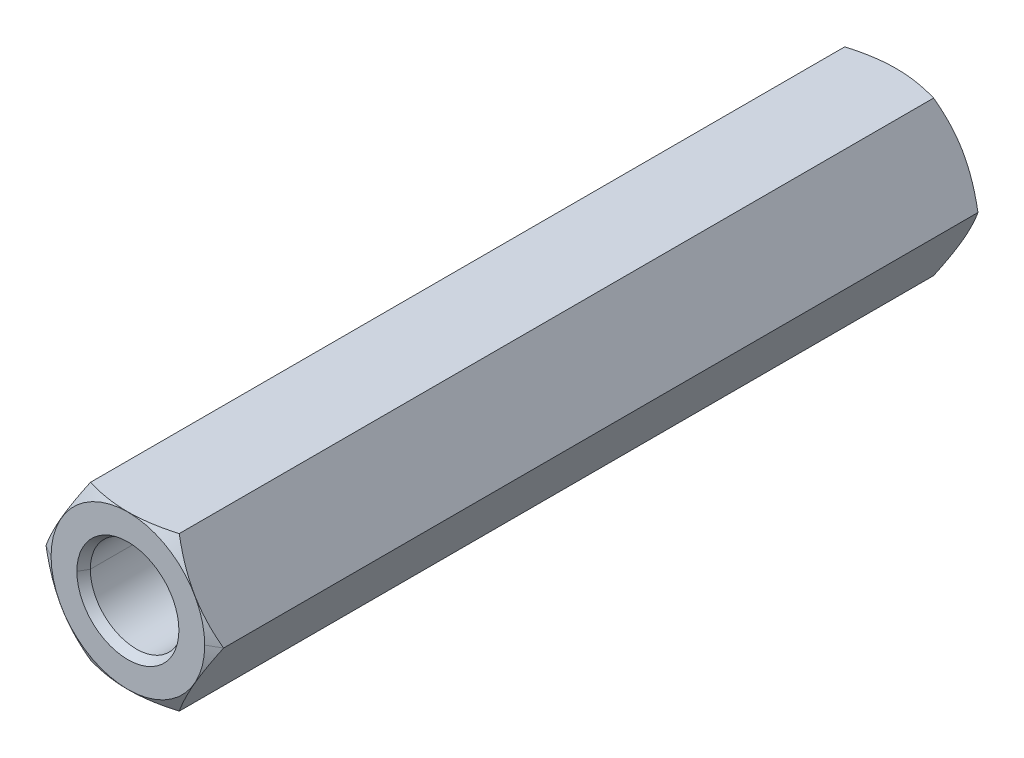
ISO-10303-21;
HEADER;
FILE_DESCRIPTION(('STEP AP214'),'2;1');
FILE_NAME('part.step','',(''),(''),'','','');
FILE_SCHEMA(('AUTOMOTIVE_DESIGN { 1 0 10303 214 1 1 1 1 }'));
ENDSEC;
DATA;
#1=APPLICATION_CONTEXT('core data for automotive mechanical design processes');
#2=APPLICATION_PROTOCOL_DEFINITION('international standard','automotive_design',2000,#1);
#3=PRODUCT_CONTEXT('',#1,'mechanical');
#4=PRODUCT('Part','Part','',(#3));
#5=PRODUCT_RELATED_PRODUCT_CATEGORY('part','',(#4));
#6=PRODUCT_DEFINITION_FORMATION('','',#4);
#7=PRODUCT_DEFINITION_CONTEXT('part definition',#1,'design');
#8=PRODUCT_DEFINITION('design','',#6,#7);
#9=PRODUCT_DEFINITION_SHAPE('','',#8);
#10=(LENGTH_UNIT() NAMED_UNIT(*) SI_UNIT(.MILLI.,.METRE.));
#11=(NAMED_UNIT(*) PLANE_ANGLE_UNIT() SI_UNIT($,.RADIAN.));
#12=(NAMED_UNIT(*) SI_UNIT($,.STERADIAN.) SOLID_ANGLE_UNIT());
#13=UNCERTAINTY_MEASURE_WITH_UNIT(LENGTH_MEASURE(1.E-05),#10,'distance_accuracy_value','');
#14=(GEOMETRIC_REPRESENTATION_CONTEXT(3) GLOBAL_UNCERTAINTY_ASSIGNED_CONTEXT((#13)) GLOBAL_UNIT_ASSIGNED_CONTEXT((#10,
#11,#12)) REPRESENTATION_CONTEXT('',''));
#15=CARTESIAN_POINT('',(0.,0.,0.));
#16=DIRECTION('',(0.,0.,1.));
#17=DIRECTION('',(1.,0.,0.));
#18=AXIS2_PLACEMENT_3D('',#15,#16,#17);
#19=CARTESIAN_POINT('',(116.318744279938,128.56204329235,90.4476083123826));
#20=DIRECTION('',(0.,0.,-1.));
#21=DIRECTION('',(1.,0.,0.));
#22=AXIS2_PLACEMENT_3D('',#19,#20,#21);
#23=CONICAL_SURFACE('',#22,1.73205080757048,1.047197551197);
#24=DIRECTION('',(0.86602540378464,0.,-0.499999999999652));
#25=VECTOR('',#24,1.);
#26=CARTESIAN_POINT('',(118.050795087508,128.56204329235,90.4476083123826));
#27=LINE('',#26,#25);
#28=CARTESIAN_POINT('',(116.318744279938,128.56204329235,91.4476083123826));
#29=VERTEX_POINT('',#28);
#30=CARTESIAN_POINT('',(117.818744279938,128.56204329235,90.5815829085986));
#31=VERTEX_POINT('',#30);
#32=EDGE_CURVE('E67',#29,#31,#27,.T.);
#33=ORIENTED_EDGE('',*,*,#32,.F.);
#34=DIRECTION('',(-0.86602540378464,0.,-0.499999999999652));
#35=VECTOR('',#34,1.);
#36=CARTESIAN_POINT('',(114.586693472367,128.56204329235,90.4476083123826));
#37=LINE('',#36,#35);
#38=CARTESIAN_POINT('',(114.818744279938,128.56204329235,90.5815829085986));
#39=VERTEX_POINT('',#38);
#40=EDGE_CURVE('E11',#29,#39,#37,.T.);
#41=ORIENTED_EDGE('',*,*,#40,.T.);
#42=CARTESIAN_POINT('',(116.318744279938,128.56204329235,90.5815829085986));
#43=DIRECTION('',(0.,0.,1.));
#44=DIRECTION('',(1.,0.,0.));
#45=AXIS2_PLACEMENT_3D('',#42,#43,#44);
#46=CIRCLE('',#45,1.5);
#47=EDGE_CURVE('E55',#31,#39,#46,.T.);
#48=ORIENTED_EDGE('',*,*,#47,.F.);
#49=EDGE_LOOP('',(#33,#41,#48));
#50=FACE_BOUND('',#49,.T.);
#51=ADVANCED_FACE('F44',(#50),#23,.F.);
#52=CARTESIAN_POINT('',(116.318744279938,128.56204329235,90.5815829085986));
#53=DIRECTION('',(0.,0.,-1.));
#54=DIRECTION('',(1.,0.,0.));
#55=AXIS2_PLACEMENT_3D('',#52,#53,#54);
#56=CYLINDRICAL_SURFACE('',#55,1.5);
#57=ORIENTED_EDGE('',*,*,#47,.T.);
#58=DIRECTION('',(0.,0.,-1.));
#59=VECTOR('',#58,1.);
#60=CARTESIAN_POINT('',(114.818744279938,128.56204329235,90.5815829085986));
#61=LINE('',#60,#59);
#62=CARTESIAN_POINT('',(114.818744279938,128.56204329235,80.8587110378087));
#63=VERTEX_POINT('',#62);
#64=EDGE_CURVE('E235',#39,#63,#61,.T.);
#65=ORIENTED_EDGE('',*,*,#64,.T.);
#66=CARTESIAN_POINT('',(116.318744279938,128.56204329235,80.8587110378087));
#67=DIRECTION('',(0.,0.,1.));
#68=DIRECTION('',(1.,0.,0.));
#69=AXIS2_PLACEMENT_3D('',#66,#67,#68);
#70=CIRCLE('',#69,1.5);
#71=CARTESIAN_POINT('',(117.818744279938,128.56204329235,80.8587110378087));
#72=VERTEX_POINT('',#71);
#73=EDGE_CURVE('E239',#72,#63,#70,.T.);
#74=ORIENTED_EDGE('',*,*,#73,.F.);
#75=DIRECTION('',(0.,0.,-1.));
#76=VECTOR('',#75,1.);
#77=CARTESIAN_POINT('',(117.818744279938,128.56204329235,90.5815829085986));
#78=LINE('',#77,#76);
#79=EDGE_CURVE('E370',#31,#72,#78,.T.);
#80=ORIENTED_EDGE('',*,*,#79,.F.);
#81=EDGE_LOOP('',(#57,#65,#74,#80));
#82=FACE_BOUND('',#81,.T.);
#83=ADVANCED_FACE('F484',(#82),#56,.F.);
#84=CARTESIAN_POINT('',(116.318744279938,128.56204329235,80.8587110378087));
#85=DIRECTION('',(0.,0.,-1.));
#86=DIRECTION('',(1.,0.,0.));
#87=AXIS2_PLACEMENT_3D('',#84,#85,#86);
#88=CONICAL_SURFACE('',#87,1.5,0.5235987756);
#89=ORIENTED_EDGE('',*,*,#73,.T.);
#90=DIRECTION('',(-0.500000000001473,0.,-0.866025403783588));
#91=VECTOR('',#90,1.);
#92=CARTESIAN_POINT('',(114.818744279938,128.56204329235,80.8587110378087));
#93=LINE('',#92,#91);
#94=CARTESIAN_POINT('',(114.658744279938,128.56204329235,80.5815829085986));
#95=VERTEX_POINT('',#94);
#96=EDGE_CURVE('E270',#63,#95,#93,.T.);
#97=ORIENTED_EDGE('',*,*,#96,.T.);
#98=CARTESIAN_POINT('',(116.318744279938,128.56204329235,80.5815829085986));
#99=DIRECTION('',(0.,0.,1.));
#100=DIRECTION('',(1.,0.,0.));
#101=AXIS2_PLACEMENT_3D('',#98,#99,#100);
#102=CIRCLE('',#101,1.66);
#103=CARTESIAN_POINT('',(117.978744279938,128.56204329235,80.5815829085986));
#104=VERTEX_POINT('',#103);
#105=EDGE_CURVE('E233',#104,#95,#102,.T.);
#106=ORIENTED_EDGE('',*,*,#105,.F.);
#107=DIRECTION('',(0.500000000001473,0.,-0.866025403783588));
#108=VECTOR('',#107,1.);
#109=CARTESIAN_POINT('',(117.818744279938,128.56204329235,80.8587110378087));
#110=LINE('',#109,#108);
#111=EDGE_CURVE('E294',#72,#104,#110,.T.);
#112=ORIENTED_EDGE('',*,*,#111,.F.);
#113=EDGE_LOOP('',(#89,#97,#106,#112));
#114=FACE_BOUND('',#113,.T.);
#115=ADVANCED_FACE('F477',(#114),#88,.F.);
#116=CARTESIAN_POINT('',(116.318744279938,128.56204329235,80.5815829085986));
#117=DIRECTION('',(0.,0.,1.));
#118=DIRECTION('',(1.,0.,0.));
#119=AXIS2_PLACEMENT_3D('',#116,#117,#118);
#120=CONICAL_SURFACE('',#119,2.5,1.047197551197);
#121=CARTESIAN_POINT('',(116.318744279938,128.56204329235,80.5815829085986));
#122=DIRECTION('',(0.,0.,1.));
#123=DIRECTION('',(1.,0.,0.));
#124=AXIS2_PLACEMENT_3D('',#121,#122,#123);
#125=CIRCLE('',#124,2.5);
#126=CARTESIAN_POINT('',(118.818744279938,128.56204329235,80.5815829085986));
#127=VERTEX_POINT('',#126);
#128=CARTESIAN_POINT('',(113.818744279938,128.56204329235,80.5815829085986));
#129=VERTEX_POINT('',#128);
#130=EDGE_CURVE('E277',#127,#129,#125,.T.);
#131=ORIENTED_EDGE('',*,*,#130,.T.);
#132=DIRECTION('',(-0.86602540378464,0.,0.499999999999652));
#133=VECTOR('',#132,1.);
#134=CARTESIAN_POINT('',(113.818744279938,128.56204329235,80.5815829085986));
#135=LINE('',#134,#133);
#136=CARTESIAN_POINT('',(113.428744279938,128.56204329235,80.8067495135827));
#137=VERTEX_POINT('',#136);
#138=EDGE_CURVE('E224',#129,#137,#135,.T.);
#139=ORIENTED_EDGE('',*,*,#138,.T.);
#140=CARTESIAN_POINT('',(114.873744279938,131.064856709287,80.8067495135827));
#141=CARTESIAN_POINT('',(114.151244279938,129.813450000819,80.3896139440931));
#142=CARTESIAN_POINT('',(113.428744279938,128.56204329235,80.8067495135827));
#143=(BOUNDED_CURVE() B_SPLINE_CURVE(2,(#140,#141,#142),.UNSPECIFIED.,.F.,
.F.) B_SPLINE_CURVE_WITH_KNOTS((3,3),(0.,1.),
.UNSPECIFIED.) CURVE() GEOMETRIC_REPRESENTATION_ITEM() RATIONAL_B_SPLINE_CURVE((1.,
1.15470053837935,1.)) REPRESENTATION_ITEM(''));
#144=CARTESIAN_POINT('',(114.873744279938,131.064856709287,80.8067495135827));
#145=VERTEX_POINT('',#144);
#146=EDGE_CURVE('E298',#145,#137,#143,.T.);
#147=ORIENTED_EDGE('',*,*,#146,.F.);
#148=CARTESIAN_POINT('',(117.763744279938,131.064856709287,80.8067495135827));
#149=CARTESIAN_POINT('',(116.318744279938,131.064856709288,80.3896139440931));
#150=CARTESIAN_POINT('',(114.873744279938,131.064856709287,80.8067495135827));
#151=(BOUNDED_CURVE() B_SPLINE_CURVE(2,(#148,#149,#150),.UNSPECIFIED.,.F.,
.F.) B_SPLINE_CURVE_WITH_KNOTS((3,3),(0.,1.),
.UNSPECIFIED.) CURVE() GEOMETRIC_REPRESENTATION_ITEM() RATIONAL_B_SPLINE_CURVE((1.,
1.15470053837926,1.)) REPRESENTATION_ITEM(''));
#152=CARTESIAN_POINT('',(117.763744279938,131.064856709287,80.8067495135827));
#153=VERTEX_POINT('',#152);
#154=EDGE_CURVE('E330',#153,#145,#151,.T.);
#155=ORIENTED_EDGE('',*,*,#154,.F.);
#156=CARTESIAN_POINT('',(119.208744279938,128.56204329235,80.8067495135827));
#157=CARTESIAN_POINT('',(118.486244279938,129.813450000819,80.389613944093));
#158=CARTESIAN_POINT('',(117.763744279938,131.064856709287,80.8067495135827));
#159=(BOUNDED_CURVE() B_SPLINE_CURVE(2,(#156,#157,#158),.UNSPECIFIED.,.F.,
.F.) B_SPLINE_CURVE_WITH_KNOTS((3,3),(0.,1.),
.UNSPECIFIED.) CURVE() GEOMETRIC_REPRESENTATION_ITEM() RATIONAL_B_SPLINE_CURVE((1.,
1.15470053837946,1.)) REPRESENTATION_ITEM(''));
#160=CARTESIAN_POINT('',(119.208744279938,128.56204329235,80.8067495135827));
#161=VERTEX_POINT('',#160);
#162=EDGE_CURVE('E251',#161,#153,#159,.T.);
#163=ORIENTED_EDGE('',*,*,#162,.F.);
#164=DIRECTION('',(0.86602540378464,0.,0.499999999999652));
#165=VECTOR('',#164,1.);
#166=CARTESIAN_POINT('',(118.818744279938,128.56204329235,80.5815829085986));
#167=LINE('',#166,#165);
#168=EDGE_CURVE('E252',#127,#161,#167,.T.);
#169=ORIENTED_EDGE('',*,*,#168,.F.);
#170=EDGE_LOOP('',(#131,#139,#147,#155,#163,#169));
#171=FACE_BOUND('',#170,.T.);
#172=ADVANCED_FACE('F459',(#171),#120,.T.);
#173=CARTESIAN_POINT('',(116.318744279938,128.56204329235,105.356416303615));
#174=DIRECTION('',(0.,0.,-1.));
#175=DIRECTION('',(1.,0.,0.));
#176=AXIS2_PLACEMENT_3D('',#173,#174,#175);
#177=CONICAL_SURFACE('',#176,2.89,1.047197551197);
#178=CARTESIAN_POINT('',(116.318744279938,128.56204329235,105.581582908599));
#179=DIRECTION('',(0.,0.,1.));
#180=DIRECTION('',(1.,0.,0.));
#181=AXIS2_PLACEMENT_3D('',#178,#179,#180);
#182=CIRCLE('',#181,2.5);
#183=CARTESIAN_POINT('',(113.818744279938,128.56204329235,105.581582908599));
#184=VERTEX_POINT('',#183);
#185=CARTESIAN_POINT('',(118.818744279938,128.56204329235,105.581582908599));
#186=VERTEX_POINT('',#185);
#187=EDGE_CURVE('E220',#184,#186,#182,.T.);
#188=ORIENTED_EDGE('',*,*,#187,.F.);
#189=DIRECTION('',(-0.86602540378464,0.,-0.499999999999652));
#190=VECTOR('',#189,1.);
#191=CARTESIAN_POINT('',(113.428744279938,128.56204329235,105.356416303615));
#192=LINE('',#191,#190);
#193=CARTESIAN_POINT('',(113.428744279938,128.562043292351,105.356416303615));
#194=VERTEX_POINT('',#193);
#195=EDGE_CURVE('E205',#184,#194,#192,.T.);
#196=ORIENTED_EDGE('',*,*,#195,.T.);
#197=CARTESIAN_POINT('',(114.873744279938,126.059229875413,105.356416303615));
#198=CARTESIAN_POINT('',(114.151244279938,127.310636583881,105.773551873104));
#199=CARTESIAN_POINT('',(113.428744279938,128.562043292351,105.356416303615));
#200=(BOUNDED_CURVE() B_SPLINE_CURVE(2,(#197,#198,#199),.UNSPECIFIED.,.F.,
.F.) B_SPLINE_CURVE_WITH_KNOTS((3,3),(0.,1.),
.UNSPECIFIED.) CURVE() GEOMETRIC_REPRESENTATION_ITEM() RATIONAL_B_SPLINE_CURVE((1.,
1.15470053837936,1.)) REPRESENTATION_ITEM(''));
#201=CARTESIAN_POINT('',(114.873744279938,126.059229875413,105.356416303615));
#202=VERTEX_POINT('',#201);
#203=EDGE_CURVE('E262',#202,#194,#200,.T.);
#204=ORIENTED_EDGE('',*,*,#203,.F.);
#205=CARTESIAN_POINT('',(117.763744279938,126.059229875413,105.356416303615));
#206=CARTESIAN_POINT('',(116.318744279938,126.059229875413,105.773551873104));
#207=CARTESIAN_POINT('',(114.873744279938,126.059229875413,105.356416303615));
#208=(BOUNDED_CURVE() B_SPLINE_CURVE(2,(#205,#206,#207),.UNSPECIFIED.,.F.,
.F.) B_SPLINE_CURVE_WITH_KNOTS((3,3),(0.,1.),
.UNSPECIFIED.) CURVE() GEOMETRIC_REPRESENTATION_ITEM() RATIONAL_B_SPLINE_CURVE((1.,
1.15470053837925,1.)) REPRESENTATION_ITEM(''));
#209=CARTESIAN_POINT('',(117.763744279938,126.059229875413,105.356416303615));
#210=VERTEX_POINT('',#209);
#211=EDGE_CURVE('E336',#210,#202,#208,.T.);
#212=ORIENTED_EDGE('',*,*,#211,.F.);
#213=CARTESIAN_POINT('',(119.208744279938,128.56204329235,105.356416303615));
#214=CARTESIAN_POINT('',(118.486244279938,127.310636583882,105.773551873104));
#215=CARTESIAN_POINT('',(117.763744279938,126.059229875413,105.356416303615));
#216=(BOUNDED_CURVE() B_SPLINE_CURVE(2,(#213,#214,#215),.UNSPECIFIED.,.F.,
.F.) B_SPLINE_CURVE_WITH_KNOTS((3,3),(0.,1.),
.UNSPECIFIED.) CURVE() GEOMETRIC_REPRESENTATION_ITEM() RATIONAL_B_SPLINE_CURVE((1.,
1.15470053837944,1.)) REPRESENTATION_ITEM(''));
#217=CARTESIAN_POINT('',(119.208744279938,128.56204329235,105.356416303615));
#218=VERTEX_POINT('',#217);
#219=EDGE_CURVE('E257',#218,#210,#216,.T.);
#220=ORIENTED_EDGE('',*,*,#219,.F.);
#221=DIRECTION('',(0.86602540378464,0.,-0.499999999999652));
#222=VECTOR('',#221,1.);
#223=CARTESIAN_POINT('',(119.208744279938,128.56204329235,105.356416303615));
#224=LINE('',#223,#222);
#225=EDGE_CURVE('E240',#186,#218,#224,.T.);
#226=ORIENTED_EDGE('',*,*,#225,.F.);
#227=EDGE_LOOP('',(#188,#196,#204,#212,#220,#226));
#228=FACE_BOUND('',#227,.T.);
#229=ADVANCED_FACE('F515',(#228),#177,.T.);
#230=CARTESIAN_POINT('',(116.318744279938,128.56204329235,105.581582908599));
#231=DIRECTION('',(0.,0.,1.));
#232=DIRECTION('',(1.,0.,0.));
#233=AXIS2_PLACEMENT_3D('',#230,#231,#232);
#234=CONICAL_SURFACE('',#233,1.65999999999899,0.523598775598);
#235=CARTESIAN_POINT('',(116.318744279938,128.56204329235,105.304454779389));
#236=DIRECTION('',(0.,0.,1.));
#237=DIRECTION('',(1.,0.,0.));
#238=AXIS2_PLACEMENT_3D('',#235,#236,#237);
#239=CIRCLE('',#238,1.5);
#240=CARTESIAN_POINT('',(114.818744279938,128.56204329235,105.304454779389));
#241=VERTEX_POINT('',#240);
#242=CARTESIAN_POINT('',(117.818744279938,128.56204329235,105.304454779389));
#243=VERTEX_POINT('',#242);
#244=EDGE_CURVE('E199',#241,#243,#239,.T.);
#245=ORIENTED_EDGE('',*,*,#244,.F.);
#246=DIRECTION('',(-0.499999999999741,0.,0.866025403784588));
#247=VECTOR('',#246,1.);
#248=CARTESIAN_POINT('',(114.658744279939,128.56204329235,105.581582908599));
#249=LINE('',#248,#247);
#250=CARTESIAN_POINT('',(114.658744279939,128.56204329235,105.581582908599));
#251=VERTEX_POINT('',#250);
#252=EDGE_CURVE('E193',#241,#251,#249,.T.);
#253=ORIENTED_EDGE('',*,*,#252,.T.);
#254=CARTESIAN_POINT('',(116.318744279938,128.56204329235,105.581582908599));
#255=DIRECTION('',(0.,0.,1.));
#256=DIRECTION('',(1.,0.,0.));
#257=AXIS2_PLACEMENT_3D('',#254,#255,#256);
#258=CIRCLE('',#257,1.65999999999899);
#259=CARTESIAN_POINT('',(117.978744279937,128.56204329235,105.581582908599));
#260=VERTEX_POINT('',#259);
#261=EDGE_CURVE('E186',#251,#260,#258,.T.);
#262=ORIENTED_EDGE('',*,*,#261,.T.);
#263=DIRECTION('',(0.499999999999741,0.,0.866025403784588));
#264=VECTOR('',#263,1.);
#265=CARTESIAN_POINT('',(117.978744279937,128.56204329235,105.581582908599));
#266=LINE('',#265,#264);
#267=EDGE_CURVE('E208',#243,#260,#266,.T.);
#268=ORIENTED_EDGE('',*,*,#267,.F.);
#269=EDGE_LOOP('',(#245,#253,#262,#268));
#270=FACE_BOUND('',#269,.T.);
#271=ADVANCED_FACE('F197',(#270),#234,.F.);
#272=CARTESIAN_POINT('',(116.318744279938,128.56204329235,105.304454779389));
#273=DIRECTION('',(0.,0.,-1.));
#274=DIRECTION('',(1.,0.,0.));
#275=AXIS2_PLACEMENT_3D('',#272,#273,#274);
#276=CYLINDRICAL_SURFACE('',#275,1.5);
#277=CARTESIAN_POINT('',(116.318744279938,128.56204329235,105.304454779389));
#278=DIRECTION('',(0.,0.,1.));
#279=DIRECTION('',(1.,0.,0.));
#280=AXIS2_PLACEMENT_3D('',#277,#278,#279);
#281=CIRCLE('',#280,1.5);
#282=EDGE_CURVE('E194',#243,#241,#281,.T.);
#283=ORIENTED_EDGE('',*,*,#282,.T.);
#284=DIRECTION('',(0.,0.,-1.));
#285=VECTOR('',#284,1.);
#286=CARTESIAN_POINT('',(114.818744279938,128.56204329235,105.304454779389));
#287=LINE('',#286,#285);
#288=CARTESIAN_POINT('',(114.818744279938,128.56204329235,95.5815829085986));
#289=VERTEX_POINT('',#288);
#290=EDGE_CURVE('E403',#241,#289,#287,.T.);
#291=ORIENTED_EDGE('',*,*,#290,.T.);
#292=CARTESIAN_POINT('',(116.318744279938,128.56204329235,95.5815829085986));
#293=DIRECTION('',(0.,0.,1.));
#294=DIRECTION('',(1.,0.,0.));
#295=AXIS2_PLACEMENT_3D('',#292,#293,#294);
#296=CIRCLE('',#295,1.5);
#297=CARTESIAN_POINT('',(117.818744279938,128.56204329235,95.5815829085986));
#298=VERTEX_POINT('',#297);
#299=EDGE_CURVE('E226',#298,#289,#296,.T.);
#300=ORIENTED_EDGE('',*,*,#299,.F.);
#301=DIRECTION('',(0.,0.,-1.));
#302=VECTOR('',#301,1.);
#303=CARTESIAN_POINT('',(117.818744279938,128.56204329235,105.304454779389));
#304=LINE('',#303,#302);
#305=EDGE_CURVE('E216',#243,#298,#304,.T.);
#306=ORIENTED_EDGE('',*,*,#305,.F.);
#307=EDGE_LOOP('',(#283,#291,#300,#306));
#308=FACE_BOUND('',#307,.T.);
#309=ADVANCED_FACE('F415',(#308),#276,.F.);
#310=CARTESIAN_POINT('',(116.318744279938,128.56204329235,95.5815829085986));
#311=DIRECTION('',(0.,0.,1.));
#312=DIRECTION('',(1.,0.,0.));
#313=AXIS2_PLACEMENT_3D('',#310,#311,#312);
#314=CONICAL_SURFACE('',#313,1.5,1.047197551197);
#315=DIRECTION('',(0.86602540378464,0.,0.499999999999652));
#316=VECTOR('',#315,1.);
#317=CARTESIAN_POINT('',(117.818744279938,128.56204329235,95.5815829085986));
#318=LINE('',#317,#316);
#319=CARTESIAN_POINT('',(116.318744279938,128.56204329235,94.7155575048136));
#320=VERTEX_POINT('',#319);
#321=EDGE_CURVE('E228',#320,#298,#318,.T.);
#322=ORIENTED_EDGE('',*,*,#321,.F.);
#323=DIRECTION('',(-0.86602540378464,0.,0.499999999999652));
#324=VECTOR('',#323,1.);
#325=CARTESIAN_POINT('',(114.818744279938,128.56204329235,95.5815829085986));
#326=LINE('',#325,#324);
#327=EDGE_CURVE('E48',#320,#289,#326,.T.);
#328=ORIENTED_EDGE('',*,*,#327,.T.);
#329=CARTESIAN_POINT('',(116.318744279938,128.56204329235,95.5815829085986));
#330=DIRECTION('',(0.,0.,1.));
#331=DIRECTION('',(1.,0.,0.));
#332=AXIS2_PLACEMENT_3D('',#329,#330,#331);
#333=CIRCLE('',#332,1.5);
#334=EDGE_CURVE('E396',#289,#298,#333,.T.);
#335=ORIENTED_EDGE('',*,*,#334,.T.);
#336=EDGE_LOOP('',(#322,#328,#335));
#337=FACE_BOUND('',#336,.T.);
#338=ADVANCED_FACE('F421',(#337),#314,.F.);
#339=CARTESIAN_POINT('',(116.318744279938,128.56204329235,95.5815829085986));
#340=DIRECTION('',(0.,0.,1.));
#341=DIRECTION('',(1.,0.,0.));
#342=AXIS2_PLACEMENT_3D('',#339,#340,#341);
#343=CONICAL_SURFACE('',#342,1.5,1.047197551197);
#344=ORIENTED_EDGE('',*,*,#327,.F.);
#345=ORIENTED_EDGE('',*,*,#321,.T.);
#346=ORIENTED_EDGE('',*,*,#299,.T.);
#347=EDGE_LOOP('',(#344,#345,#346));
#348=FACE_BOUND('',#347,.T.);
#349=ADVANCED_FACE('F419',(#348),#343,.F.);
#350=CARTESIAN_POINT('',(116.318744279938,128.56204329235,105.304454779389));
#351=DIRECTION('',(0.,0.,-1.));
#352=DIRECTION('',(1.,0.,0.));
#353=AXIS2_PLACEMENT_3D('',#350,#351,#352);
#354=CYLINDRICAL_SURFACE('',#353,1.5);
#355=ORIENTED_EDGE('',*,*,#290,.F.);
#356=ORIENTED_EDGE('',*,*,#244,.T.);
#357=ORIENTED_EDGE('',*,*,#305,.T.);
#358=ORIENTED_EDGE('',*,*,#334,.F.);
#359=EDGE_LOOP('',(#355,#356,#357,#358));
#360=FACE_BOUND('',#359,.T.);
#361=ADVANCED_FACE('F411',(#360),#354,.F.);
#362=CARTESIAN_POINT('',(116.318744279938,128.56204329235,105.581582908599));
#363=DIRECTION('',(0.,0.,1.));
#364=DIRECTION('',(1.,0.,0.));
#365=AXIS2_PLACEMENT_3D('',#362,#363,#364);
#366=CONICAL_SURFACE('',#365,1.65999999999899,0.523598775598);
#367=ORIENTED_EDGE('',*,*,#252,.F.);
#368=ORIENTED_EDGE('',*,*,#282,.F.);
#369=ORIENTED_EDGE('',*,*,#267,.T.);
#370=CARTESIAN_POINT('',(116.318744279938,128.56204329235,105.581582908599));
#371=DIRECTION('',(0.,0.,1.));
#372=DIRECTION('',(1.,0.,0.));
#373=AXIS2_PLACEMENT_3D('',#370,#371,#372);
#374=CIRCLE('',#373,1.65999999999899);
#375=EDGE_CURVE('E190',#260,#251,#374,.T.);
#376=ORIENTED_EDGE('',*,*,#375,.T.);
#377=EDGE_LOOP('',(#367,#368,#369,#376));
#378=FACE_BOUND('',#377,.T.);
#379=ADVANCED_FACE('F207',(#378),#366,.F.);
#380=CARTESIAN_POINT('',(116.318744279938,128.56204329235,105.581582908599));
#381=DIRECTION('',(0.,0.,1.));
#382=DIRECTION('',(1.,0.,0.));
#383=AXIS2_PLACEMENT_3D('',#380,#381,#382);
#384=PLANE('',#383);
#385=CARTESIAN_POINT('',(116.318744279938,128.56204329235,105.581582908599));
#386=DIRECTION('',(0.,0.,1.));
#387=DIRECTION('',(1.,0.,0.));
#388=AXIS2_PLACEMENT_3D('',#385,#386,#387);
#389=CIRCLE('',#388,2.5);
#390=EDGE_CURVE('E210',#186,#184,#389,.T.);
#391=ORIENTED_EDGE('',*,*,#390,.T.);
#392=ORIENTED_EDGE('',*,*,#187,.T.);
#393=EDGE_LOOP('',(#391,#392));
#394=FACE_BOUND('',#393,.T.);
#395=ORIENTED_EDGE('',*,*,#375,.F.);
#396=ORIENTED_EDGE('',*,*,#261,.F.);
#397=EDGE_LOOP('',(#395,#396));
#398=FACE_BOUND('',#397,.T.);
#399=ADVANCED_FACE('F188',(#394,#398),#384,.T.);
#400=CARTESIAN_POINT('',(116.318744279938,128.56204329235,105.356416303615));
#401=DIRECTION('',(0.,0.,-1.));
#402=DIRECTION('',(1.,0.,0.));
#403=AXIS2_PLACEMENT_3D('',#400,#401,#402);
#404=CONICAL_SURFACE('',#403,2.89,1.047197551197);
#405=ORIENTED_EDGE('',*,*,#195,.F.);
#406=ORIENTED_EDGE('',*,*,#390,.F.);
#407=ORIENTED_EDGE('',*,*,#225,.T.);
#408=CARTESIAN_POINT('',(117.763744279938,131.064856709287,105.356416303615));
#409=CARTESIAN_POINT('',(118.486244279938,129.813450000819,105.773551873104));
#410=CARTESIAN_POINT('',(119.208744279938,128.56204329235,105.356416303615));
#411=(BOUNDED_CURVE() B_SPLINE_CURVE(2,(#408,#409,#410),.UNSPECIFIED.,.F.,
.F.) B_SPLINE_CURVE_WITH_KNOTS((3,3),(0.,1.),
.UNSPECIFIED.) CURVE() GEOMETRIC_REPRESENTATION_ITEM() RATIONAL_B_SPLINE_CURVE((1.,
1.15470053837935,1.)) REPRESENTATION_ITEM(''));
#412=CARTESIAN_POINT('',(117.763744279938,131.064856709287,105.356416303615));
#413=VERTEX_POINT('',#412);
#414=EDGE_CURVE('E281',#413,#218,#411,.T.);
#415=ORIENTED_EDGE('',*,*,#414,.F.);
#416=CARTESIAN_POINT('',(114.873744279938,131.064856709287,105.356416303615));
#417=CARTESIAN_POINT('',(116.318744279938,131.064856709287,105.773551873104));
#418=CARTESIAN_POINT('',(117.763744279938,131.064856709287,105.356416303615));
#419=(BOUNDED_CURVE() B_SPLINE_CURVE(2,(#416,#417,#418),.UNSPECIFIED.,.F.,
.F.) B_SPLINE_CURVE_WITH_KNOTS((3,3),(0.,1.),
.UNSPECIFIED.) CURVE() GEOMETRIC_REPRESENTATION_ITEM() RATIONAL_B_SPLINE_CURVE((1.,
1.15470053837925,1.)) REPRESENTATION_ITEM(''));
#420=CARTESIAN_POINT('',(114.873744279938,131.064856709287,105.356416303615));
#421=VERTEX_POINT('',#420);
#422=EDGE_CURVE('E161',#421,#413,#419,.T.);
#423=ORIENTED_EDGE('',*,*,#422,.F.);
#424=CARTESIAN_POINT('',(113.428744279938,128.562043292351,105.356416303615));
#425=CARTESIAN_POINT('',(114.151244279937,129.813450000819,105.773551873104));
#426=CARTESIAN_POINT('',(114.873744279938,131.064856709287,105.356416303615));
#427=(BOUNDED_CURVE() B_SPLINE_CURVE(2,(#424,#425,#426),.UNSPECIFIED.,.F.,
.F.) B_SPLINE_CURVE_WITH_KNOTS((3,3),(0.,1.),
.UNSPECIFIED.) CURVE() GEOMETRIC_REPRESENTATION_ITEM() RATIONAL_B_SPLINE_CURVE((1.,
1.15470053837944,1.)) REPRESENTATION_ITEM(''));
#428=EDGE_CURVE('E303',#194,#421,#427,.T.);
#429=ORIENTED_EDGE('',*,*,#428,.F.);
#430=EDGE_LOOP('',(#405,#406,#407,#415,#423,#429));
#431=FACE_BOUND('',#430,.T.);
#432=ADVANCED_FACE('F502',(#431),#404,.T.);
#433=CARTESIAN_POINT('',(117.763744279938,126.059229875413,80.5815829085986));
#434=DIRECTION('',(-0.866025403784329,0.50000000000019,0.));
#435=DIRECTION('',(0.,0.,1.));
#436=AXIS2_PLACEMENT_3D('',#433,#434,#435);
#437=PLANE('',#436);
#438=DIRECTION('',(0.,0.,1.));
#439=VECTOR('',#438,1.);
#440=CARTESIAN_POINT('',(119.208744279938,128.56204329235,80.8067495135827));
#441=LINE('',#440,#439);
#442=EDGE_CURVE('E244',#161,#218,#441,.T.);
#443=ORIENTED_EDGE('',*,*,#442,.T.);
#444=ORIENTED_EDGE('',*,*,#219,.T.);
#445=DIRECTION('',(0.,0.,1.));
#446=VECTOR('',#445,1.);
#447=CARTESIAN_POINT('',(117.763744279938,126.059229875413,80.5815829085986));
#448=LINE('',#447,#446);
#449=CARTESIAN_POINT('',(117.763744279938,126.059229875413,80.8067495135827));
#450=VERTEX_POINT('',#449);
#451=EDGE_CURVE('E173',#450,#210,#448,.T.);
#452=ORIENTED_EDGE('',*,*,#451,.F.);
#453=CARTESIAN_POINT('',(117.763744279938,126.059229875413,80.8067495135827));
#454=CARTESIAN_POINT('',(118.486244279938,127.310636583881,80.389613944093));
#455=CARTESIAN_POINT('',(119.208744279938,128.56204329235,80.8067495135827));
#456=(BOUNDED_CURVE() B_SPLINE_CURVE(2,(#453,#454,#455),.UNSPECIFIED.,.F.,
.F.) B_SPLINE_CURVE_WITH_KNOTS((3,3),(0.,1.),
.UNSPECIFIED.) CURVE() GEOMETRIC_REPRESENTATION_ITEM() RATIONAL_B_SPLINE_CURVE((1.,
1.15470053837935,1.)) REPRESENTATION_ITEM(''));
#457=EDGE_CURVE('E253',#450,#161,#456,.T.);
#458=ORIENTED_EDGE('',*,*,#457,.T.);
#459=EDGE_LOOP('',(#443,#444,#452,#458));
#460=FACE_BOUND('',#459,.T.);
#461=ADVANCED_FACE('F443',(#460),#437,.F.);
#462=CARTESIAN_POINT('',(114.873744279938,126.059229875413,80.5815829085986));
#463=DIRECTION('',(0.,1.,0.));
#464=DIRECTION('',(1.,0.,0.));
#465=AXIS2_PLACEMENT_3D('',#462,#463,#464);
#466=PLANE('',#465);
#467=ORIENTED_EDGE('',*,*,#451,.T.);
#468=ORIENTED_EDGE('',*,*,#211,.T.);
#469=DIRECTION('',(0.,0.,1.));
#470=VECTOR('',#469,1.);
#471=CARTESIAN_POINT('',(114.873744279938,126.059229875413,80.5815829085986));
#472=LINE('',#471,#470);
#473=CARTESIAN_POINT('',(114.873744279938,126.059229875413,80.8067495135827));
#474=VERTEX_POINT('',#473);
#475=EDGE_CURVE('E268',#474,#202,#472,.T.);
#476=ORIENTED_EDGE('',*,*,#475,.F.);
#477=CARTESIAN_POINT('',(114.873744279938,126.059229875413,80.8067495135827));
#478=CARTESIAN_POINT('',(116.318744279938,126.059229875413,80.3896139440931));
#479=CARTESIAN_POINT('',(117.763744279938,126.059229875413,80.8067495135827));
#480=(BOUNDED_CURVE() B_SPLINE_CURVE(2,(#477,#478,#479),.UNSPECIFIED.,.F.,
.F.) B_SPLINE_CURVE_WITH_KNOTS((3,3),(0.,1.),
.UNSPECIFIED.) CURVE() GEOMETRIC_REPRESENTATION_ITEM() RATIONAL_B_SPLINE_CURVE((1.,
1.15470053837926,1.)) REPRESENTATION_ITEM(''));
#481=EDGE_CURVE('E319',#474,#450,#480,.T.);
#482=ORIENTED_EDGE('',*,*,#481,.T.);
#483=EDGE_LOOP('',(#467,#468,#476,#482));
#484=FACE_BOUND('',#483,.T.);
#485=ADVANCED_FACE('F447',(#484),#466,.F.);
#486=CARTESIAN_POINT('',(113.428744279938,128.56204329235,80.5815829085986));
#487=DIRECTION('',(0.866025403784329,0.50000000000019,0.));
#488=DIRECTION('',(0.,0.,-1.));
#489=AXIS2_PLACEMENT_3D('',#486,#487,#488);
#490=PLANE('',#489);
#491=ORIENTED_EDGE('',*,*,#475,.T.);
#492=ORIENTED_EDGE('',*,*,#203,.T.);
#493=DIRECTION('',(0.,0.,1.));
#494=VECTOR('',#493,1.);
#495=CARTESIAN_POINT('',(113.428744279938,128.56204329235,80.5815829085986));
#496=LINE('',#495,#494);
#497=EDGE_CURVE('E341',#137,#194,#496,.T.);
#498=ORIENTED_EDGE('',*,*,#497,.F.);
#499=CARTESIAN_POINT('',(113.428744279938,128.56204329235,80.8067495135827));
#500=CARTESIAN_POINT('',(114.151244279937,127.310636583882,80.3896139440929));
#501=CARTESIAN_POINT('',(114.873744279938,126.059229875413,80.8067495135827));
#502=(BOUNDED_CURVE() B_SPLINE_CURVE(2,(#499,#500,#501),.UNSPECIFIED.,.F.,
.F.) B_SPLINE_CURVE_WITH_KNOTS((3,3),(0.,1.),
.UNSPECIFIED.) CURVE() GEOMETRIC_REPRESENTATION_ITEM() RATIONAL_B_SPLINE_CURVE((1.,
1.15470053837945,1.)) REPRESENTATION_ITEM(''));
#503=EDGE_CURVE('E269',#137,#474,#502,.T.);
#504=ORIENTED_EDGE('',*,*,#503,.T.);
#505=EDGE_LOOP('',(#491,#492,#498,#504));
#506=FACE_BOUND('',#505,.T.);
#507=ADVANCED_FACE('F454',(#506),#490,.F.);
#508=CARTESIAN_POINT('',(114.873744279938,131.064856709287,80.5815829085986));
#509=DIRECTION('',(0.866025403784329,-0.50000000000019,0.));
#510=DIRECTION('',(0.,0.,-1.));
#511=AXIS2_PLACEMENT_3D('',#508,#509,#510);
#512=PLANE('',#511);
#513=ORIENTED_EDGE('',*,*,#497,.T.);
#514=ORIENTED_EDGE('',*,*,#428,.T.);
#515=DIRECTION('',(0.,0.,1.));
#516=VECTOR('',#515,1.);
#517=CARTESIAN_POINT('',(114.873744279938,131.064856709287,80.5815829085986));
#518=LINE('',#517,#516);
#519=EDGE_CURVE('E304',#145,#421,#518,.T.);
#520=ORIENTED_EDGE('',*,*,#519,.F.);
#521=ORIENTED_EDGE('',*,*,#146,.T.);
#522=EDGE_LOOP('',(#513,#514,#520,#521));
#523=FACE_BOUND('',#522,.T.);
#524=ADVANCED_FACE('F520',(#523),#512,.F.);
#525=CARTESIAN_POINT('',(117.763744279938,131.064856709287,80.5815829085986));
#526=DIRECTION('',(0.,-1.,0.));
#527=DIRECTION('',(-1.,0.,0.));
#528=AXIS2_PLACEMENT_3D('',#525,#526,#527);
#529=PLANE('',#528);
#530=ORIENTED_EDGE('',*,*,#519,.T.);
#531=ORIENTED_EDGE('',*,*,#422,.T.);
#532=DIRECTION('',(0.,0.,1.));
#533=VECTOR('',#532,1.);
#534=CARTESIAN_POINT('',(117.763744279938,131.064856709287,80.5815829085986));
#535=LINE('',#534,#533);
#536=EDGE_CURVE('E312',#153,#413,#535,.T.);
#537=ORIENTED_EDGE('',*,*,#536,.F.);
#538=ORIENTED_EDGE('',*,*,#154,.T.);
#539=EDGE_LOOP('',(#530,#531,#537,#538));
#540=FACE_BOUND('',#539,.T.);
#541=ADVANCED_FACE('F500',(#540),#529,.F.);
#542=CARTESIAN_POINT('',(119.208744279938,128.56204329235,80.5815829085986));
#543=DIRECTION('',(-0.866025403784329,-0.50000000000019,0.));
#544=DIRECTION('',(-0.50000000000019,0.866025403784329,0.));
#545=AXIS2_PLACEMENT_3D('',#542,#543,#544);
#546=PLANE('',#545);
#547=ORIENTED_EDGE('',*,*,#536,.T.);
#548=ORIENTED_EDGE('',*,*,#414,.T.);
#549=ORIENTED_EDGE('',*,*,#442,.F.);
#550=ORIENTED_EDGE('',*,*,#162,.T.);
#551=EDGE_LOOP('',(#547,#548,#549,#550));
#552=FACE_BOUND('',#551,.T.);
#553=ADVANCED_FACE('F46',(#552),#546,.F.);
#554=CARTESIAN_POINT('',(116.318744279938,128.56204329235,80.5815829085986));
#555=DIRECTION('',(0.,0.,1.));
#556=DIRECTION('',(1.,0.,0.));
#557=AXIS2_PLACEMENT_3D('',#554,#555,#556);
#558=CONICAL_SURFACE('',#557,2.5,1.047197551197);
#559=ORIENTED_EDGE('',*,*,#138,.F.);
#560=CARTESIAN_POINT('',(116.318744279938,128.56204329235,80.5815829085986));
#561=DIRECTION('',(0.,0.,1.));
#562=DIRECTION('',(1.,0.,0.));
#563=AXIS2_PLACEMENT_3D('',#560,#561,#562);
#564=CIRCLE('',#563,2.5);
#565=EDGE_CURVE('E247',#129,#127,#564,.T.);
#566=ORIENTED_EDGE('',*,*,#565,.T.);
#567=ORIENTED_EDGE('',*,*,#168,.T.);
#568=ORIENTED_EDGE('',*,*,#457,.F.);
#569=ORIENTED_EDGE('',*,*,#481,.F.);
#570=ORIENTED_EDGE('',*,*,#503,.F.);
#571=EDGE_LOOP('',(#559,#566,#567,#568,#569,#570));
#572=FACE_BOUND('',#571,.T.);
#573=ADVANCED_FACE('F451',(#572),#558,.T.);
#574=CARTESIAN_POINT('',(116.318744279938,128.56204329235,80.5815829085986));
#575=DIRECTION('',(0.,0.,1.));
#576=DIRECTION('',(1.,0.,0.));
#577=AXIS2_PLACEMENT_3D('',#574,#575,#576);
#578=PLANE('',#577);
#579=ORIENTED_EDGE('',*,*,#130,.F.);
#580=ORIENTED_EDGE('',*,*,#565,.F.);
#581=EDGE_LOOP('',(#579,#580));
#582=FACE_BOUND('',#581,.T.);
#583=ORIENTED_EDGE('',*,*,#105,.T.);
#584=CARTESIAN_POINT('',(116.318744279938,128.56204329235,80.5815829085986));
#585=DIRECTION('',(0.,0.,1.));
#586=DIRECTION('',(1.,0.,0.));
#587=AXIS2_PLACEMENT_3D('',#584,#585,#586);
#588=CIRCLE('',#587,1.66);
#589=EDGE_CURVE('E229',#95,#104,#588,.T.);
#590=ORIENTED_EDGE('',*,*,#589,.T.);
#591=EDGE_LOOP('',(#583,#590));
#592=FACE_BOUND('',#591,.T.);
#593=ADVANCED_FACE('F467',(#582,#592),#578,.F.);
#594=CARTESIAN_POINT('',(116.318744279938,128.56204329235,80.8587110378087));
#595=DIRECTION('',(0.,0.,-1.));
#596=DIRECTION('',(1.,0.,0.));
#597=AXIS2_PLACEMENT_3D('',#594,#595,#596);
#598=CONICAL_SURFACE('',#597,1.5,0.5235987756);
#599=ORIENTED_EDGE('',*,*,#96,.F.);
#600=CARTESIAN_POINT('',(116.318744279938,128.56204329235,80.8587110378087));
#601=DIRECTION('',(0.,0.,1.));
#602=DIRECTION('',(1.,0.,0.));
#603=AXIS2_PLACEMENT_3D('',#600,#601,#602);
#604=CIRCLE('',#603,1.5);
#605=EDGE_CURVE('E234',#63,#72,#604,.T.);
#606=ORIENTED_EDGE('',*,*,#605,.T.);
#607=ORIENTED_EDGE('',*,*,#111,.T.);
#608=ORIENTED_EDGE('',*,*,#589,.F.);
#609=EDGE_LOOP('',(#599,#606,#607,#608));
#610=FACE_BOUND('',#609,.T.);
#611=ADVANCED_FACE('F470',(#610),#598,.F.);
#612=CARTESIAN_POINT('',(116.318744279938,128.56204329235,90.5815829085986));
#613=DIRECTION('',(0.,0.,-1.));
#614=DIRECTION('',(1.,0.,0.));
#615=AXIS2_PLACEMENT_3D('',#612,#613,#614);
#616=CYLINDRICAL_SURFACE('',#615,1.5);
#617=ORIENTED_EDGE('',*,*,#64,.F.);
#618=CARTESIAN_POINT('',(116.318744279938,128.56204329235,90.5815829085986));
#619=DIRECTION('',(0.,0.,1.));
#620=DIRECTION('',(1.,0.,0.));
#621=AXIS2_PLACEMENT_3D('',#618,#619,#620);
#622=CIRCLE('',#621,1.5);
#623=EDGE_CURVE('E297',#39,#31,#622,.T.);
#624=ORIENTED_EDGE('',*,*,#623,.T.);
#625=ORIENTED_EDGE('',*,*,#79,.T.);
#626=ORIENTED_EDGE('',*,*,#605,.F.);
#627=EDGE_LOOP('',(#617,#624,#625,#626));
#628=FACE_BOUND('',#627,.T.);
#629=ADVANCED_FACE('F486',(#628),#616,.F.);
#630=CARTESIAN_POINT('',(116.318744279938,128.56204329235,90.4476083123826));
#631=DIRECTION('',(0.,0.,-1.));
#632=DIRECTION('',(1.,0.,0.));
#633=AXIS2_PLACEMENT_3D('',#630,#631,#632);
#634=CONICAL_SURFACE('',#633,1.73205080757048,1.047197551197);
#635=ORIENTED_EDGE('',*,*,#40,.F.);
#636=ORIENTED_EDGE('',*,*,#32,.T.);
#637=ORIENTED_EDGE('',*,*,#623,.F.);
#638=EDGE_LOOP('',(#635,#636,#637));
#639=FACE_BOUND('',#638,.T.);
#640=ADVANCED_FACE('F491',(#639),#634,.F.);
#641=CLOSED_SHELL('',(#51,#83,#115,#172,#229,#271,#309,#338,#349,#361,#379,#399,#432,#461,#485,
#507,#524,#541,#553,#573,#593,#611,#629,#640));
#642=MANIFOLD_SOLID_BREP('B2',#641);
#643=ADVANCED_BREP_SHAPE_REPRESENTATION('',(#18,#642),#14);
#644=SHAPE_DEFINITION_REPRESENTATION(#9,#643);
ENDSEC;
END-ISO-10303-21;
